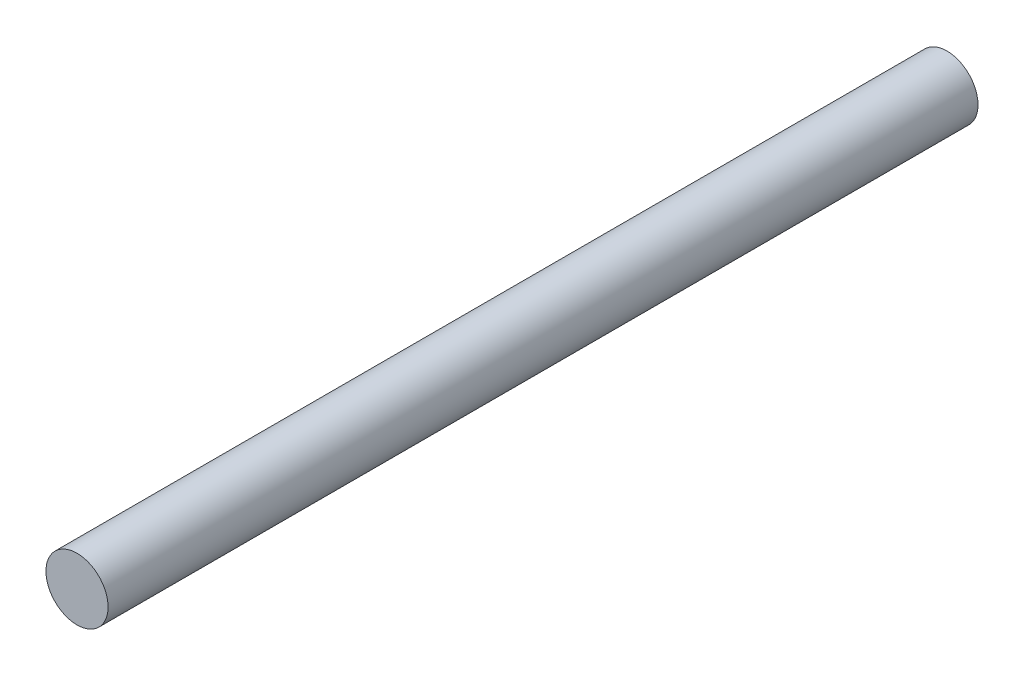
ISO-10303-21;
HEADER;
FILE_DESCRIPTION(('STEP AP214'),'2;1');
FILE_NAME('part.step','',(''),(''),'','','');
FILE_SCHEMA(('AUTOMOTIVE_DESIGN { 1 0 10303 214 1 1 1 1 }'));
ENDSEC;
DATA;
#1=APPLICATION_CONTEXT('core data for automotive mechanical design processes');
#2=APPLICATION_PROTOCOL_DEFINITION('international standard','automotive_design',2000,#1);
#3=PRODUCT_CONTEXT('',#1,'mechanical');
#4=PRODUCT('Part','Part','',(#3));
#5=PRODUCT_RELATED_PRODUCT_CATEGORY('part','',(#4));
#6=PRODUCT_DEFINITION_FORMATION('','',#4);
#7=PRODUCT_DEFINITION_CONTEXT('part definition',#1,'design');
#8=PRODUCT_DEFINITION('design','',#6,#7);
#9=PRODUCT_DEFINITION_SHAPE('','',#8);
#10=(LENGTH_UNIT() NAMED_UNIT(*) SI_UNIT(.MILLI.,.METRE.));
#11=(NAMED_UNIT(*) PLANE_ANGLE_UNIT() SI_UNIT($,.RADIAN.));
#12=(NAMED_UNIT(*) SI_UNIT($,.STERADIAN.) SOLID_ANGLE_UNIT());
#13=UNCERTAINTY_MEASURE_WITH_UNIT(LENGTH_MEASURE(1.E-05),#10,'distance_accuracy_value','');
#14=(GEOMETRIC_REPRESENTATION_CONTEXT(3) GLOBAL_UNCERTAINTY_ASSIGNED_CONTEXT((#13)) GLOBAL_UNIT_ASSIGNED_CONTEXT((#10,
#11,#12)) REPRESENTATION_CONTEXT('',''));
#15=CARTESIAN_POINT('',(0.,0.,0.));
#16=DIRECTION('',(0.,0.,1.));
#17=DIRECTION('',(1.,0.,0.));
#18=AXIS2_PLACEMENT_3D('',#15,#16,#17);
#19=CARTESIAN_POINT('',(0.,0.,88.9));
#20=DIRECTION('',(0.,0.,-1.));
#21=DIRECTION('',(-1.,0.,0.));
#22=AXIS2_PLACEMENT_3D('',#19,#20,#21);
#23=CYLINDRICAL_SURFACE('',#22,3.175);
#24=CARTESIAN_POINT('',(0.,0.,88.9));
#25=DIRECTION('',(0.,0.,1.));
#26=DIRECTION('',(1.,0.,0.));
#27=AXIS2_PLACEMENT_3D('',#24,#25,#26);
#28=CIRCLE('',#27,3.175);
#29=CARTESIAN_POINT('',(3.175,0.,88.9));
#30=VERTEX_POINT('',#29);
#31=EDGE_CURVE('E10',#30,#30,#28,.T.);
#32=ORIENTED_EDGE('',*,*,#31,.F.);
#33=EDGE_LOOP('',(#32));
#34=FACE_BOUND('',#33,.T.);
#35=CARTESIAN_POINT('',(0.,0.,0.));
#36=DIRECTION('',(0.,0.,1.));
#37=DIRECTION('',(1.,0.,0.));
#38=AXIS2_PLACEMENT_3D('',#35,#36,#37);
#39=CIRCLE('',#38,3.175);
#40=CARTESIAN_POINT('',(3.175,0.,0.));
#41=VERTEX_POINT('',#40);
#42=EDGE_CURVE('E46',#41,#41,#39,.T.);
#43=ORIENTED_EDGE('',*,*,#42,.T.);
#44=EDGE_LOOP('',(#43));
#45=FACE_BOUND('',#44,.T.);
#46=ADVANCED_FACE('F43',(#34,#45),#23,.T.);
#47=CARTESIAN_POINT('',(0.,0.,88.9));
#48=DIRECTION('',(0.,0.,1.));
#49=DIRECTION('',(1.,0.,0.));
#50=AXIS2_PLACEMENT_3D('',#47,#48,#49);
#51=PLANE('',#50);
#52=ORIENTED_EDGE('',*,*,#31,.T.);
#53=EDGE_LOOP('',(#52));
#54=FACE_BOUND('',#53,.T.);
#55=ADVANCED_FACE('F60',(#54),#51,.T.);
#56=CARTESIAN_POINT('',(0.,0.,0.));
#57=DIRECTION('',(0.,0.,1.));
#58=DIRECTION('',(1.,0.,0.));
#59=AXIS2_PLACEMENT_3D('',#56,#57,#58);
#60=PLANE('',#59);
#61=ORIENTED_EDGE('',*,*,#42,.F.);
#62=EDGE_LOOP('',(#61));
#63=FACE_BOUND('',#62,.T.);
#64=ADVANCED_FACE('F58',(#63),#60,.F.);
#65=CLOSED_SHELL('',(#46,#55,#64));
#66=MANIFOLD_SOLID_BREP('B2',#65);
#67=ADVANCED_BREP_SHAPE_REPRESENTATION('',(#18,#66),#14);
#68=SHAPE_DEFINITION_REPRESENTATION(#9,#67);
ENDSEC;
END-ISO-10303-21;
